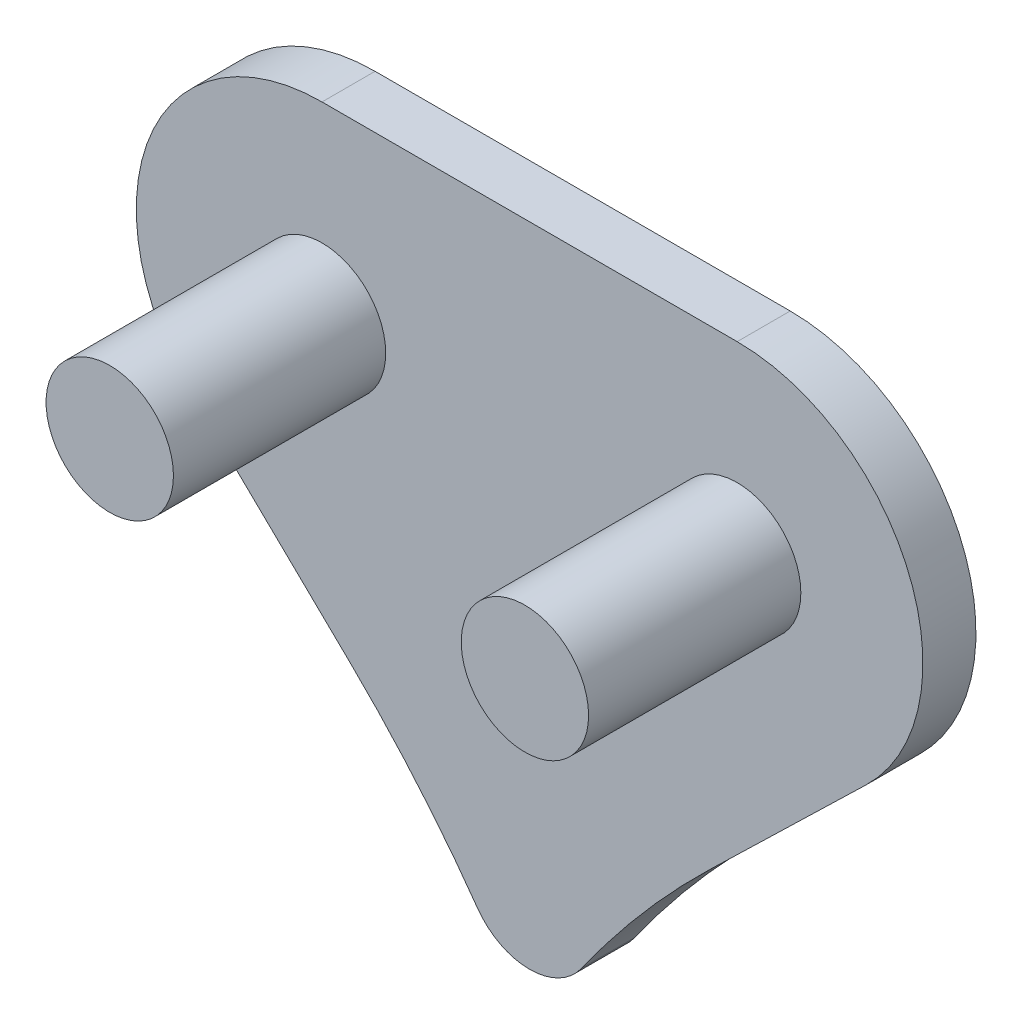
ISO-10303-21;
HEADER;
FILE_DESCRIPTION(('STEP AP214'),'2;1');
FILE_NAME('part.step','',(''),(''),'','','');
FILE_SCHEMA(('AUTOMOTIVE_DESIGN { 1 0 10303 214 1 1 1 1 }'));
ENDSEC;
DATA;
#1=APPLICATION_CONTEXT('core data for automotive mechanical design processes');
#2=APPLICATION_PROTOCOL_DEFINITION('international standard','automotive_design',2000,#1);
#3=PRODUCT_CONTEXT('',#1,'mechanical');
#4=PRODUCT('Part','Part','',(#3));
#5=PRODUCT_RELATED_PRODUCT_CATEGORY('part','',(#4));
#6=PRODUCT_DEFINITION_FORMATION('','',#4);
#7=PRODUCT_DEFINITION_CONTEXT('part definition',#1,'design');
#8=PRODUCT_DEFINITION('design','',#6,#7);
#9=PRODUCT_DEFINITION_SHAPE('','',#8);
#10=(LENGTH_UNIT() NAMED_UNIT(*) SI_UNIT(.MILLI.,.METRE.));
#11=(NAMED_UNIT(*) PLANE_ANGLE_UNIT() SI_UNIT($,.RADIAN.));
#12=(NAMED_UNIT(*) SI_UNIT($,.STERADIAN.) SOLID_ANGLE_UNIT());
#13=UNCERTAINTY_MEASURE_WITH_UNIT(LENGTH_MEASURE(1.E-05),#10,'distance_accuracy_value','');
#14=(GEOMETRIC_REPRESENTATION_CONTEXT(3) GLOBAL_UNCERTAINTY_ASSIGNED_CONTEXT((#13)) GLOBAL_UNIT_ASSIGNED_CONTEXT((#10,
#11,#12)) REPRESENTATION_CONTEXT('',''));
#15=CARTESIAN_POINT('',(0.,0.,0.));
#16=DIRECTION('',(0.,0.,1.));
#17=DIRECTION('',(1.,0.,0.));
#18=AXIS2_PLACEMENT_3D('',#15,#16,#17);
#19=CARTESIAN_POINT('',(-8.09521489057323,-9.86950796640979,0.5));
#20=DIRECTION('',(0.,0.,-1.));
#21=DIRECTION('',(-1.,0.,0.));
#22=AXIS2_PLACEMENT_3D('',#19,#20,#21);
#23=PLANE('',#22);
#24=CARTESIAN_POINT('',(-8.09521489057323,-9.86950796640979,0.5));
#25=DIRECTION('',(0.,0.,-1.));
#26=DIRECTION('',(-1.,0.,0.));
#27=AXIS2_PLACEMENT_3D('',#24,#25,#26);
#28=CIRCLE('',#27,9.99999999999999);
#29=CARTESIAN_POINT('',(-1.13731739875534,-2.68705278079573,0.5));
#30=VERTEX_POINT('',#29);
#31=CARTESIAN_POINT('',(0.0700209980795479,-4.09638724338169,0.5));
#32=VERTEX_POINT('',#31);
#33=EDGE_CURVE('E144',#30,#32,#28,.T.);
#34=ORIENTED_EDGE('',*,*,#33,.T.);
#35=CARTESIAN_POINT('',(0.559935151398721,-3.75,0.5));
#36=DIRECTION('',(0.,0.,1.));
#37=DIRECTION('',(1.,0.,0.));
#38=AXIS2_PLACEMENT_3D('',#35,#36,#37);
#39=CIRCLE('',#38,0.600000000000005);
#40=CARTESIAN_POINT('',(1.04984930471789,-4.09638724338169,0.5));
#41=VERTEX_POINT('',#40);
#42=EDGE_CURVE('E92',#32,#41,#39,.T.);
#43=ORIENTED_EDGE('',*,*,#42,.T.);
#44=CARTESIAN_POINT('',(9.21508519337068,-9.86950796640978,0.5));
#45=DIRECTION('',(0.,0.,-1.));
#46=DIRECTION('',(1.,0.,0.));
#47=AXIS2_PLACEMENT_3D('',#44,#45,#46);
#48=CIRCLE('',#47,10.);
#49=CARTESIAN_POINT('',(2.25718770155278,-2.68705278079573,0.5));
#50=VERTEX_POINT('',#49);
#51=EDGE_CURVE('E159',#41,#50,#48,.T.);
#52=ORIENTED_EDGE('',*,*,#51,.T.);
#53=DIRECTION('',(0.718245518561405,0.69578974918179,0.));
#54=VECTOR('',#53,1.);
#55=CARTESIAN_POINT('',(2.25718770155278,-2.68705278079573,0.5));
#56=LINE('',#55,#54);
#57=CARTESIAN_POINT('',(3.73346631232378,-1.25692965748246,0.5));
#58=VERTEX_POINT('',#57);
#59=EDGE_CURVE('E171',#50,#58,#56,.T.);
#60=ORIENTED_EDGE('',*,*,#59,.T.);
#61=CARTESIAN_POINT('',(2.51583425125565,0.,0.5));
#62=DIRECTION('',(0.,0.,1.));
#63=DIRECTION('',(1.,0.,0.));
#64=AXIS2_PLACEMENT_3D('',#61,#62,#63);
#65=CIRCLE('',#64,1.75);
#66=CARTESIAN_POINT('',(2.51583425125565,1.75,0.5));
#67=VERTEX_POINT('',#66);
#68=EDGE_CURVE('E111',#58,#67,#65,.T.);
#69=ORIENTED_EDGE('',*,*,#68,.T.);
#70=DIRECTION('',(-1.,0.,0.));
#71=VECTOR('',#70,1.);
#72=CARTESIAN_POINT('',(-1.39596394845821,1.75,0.5));
#73=LINE('',#72,#71);
#74=CARTESIAN_POINT('',(-1.39596394845821,1.75,0.5));
#75=VERTEX_POINT('',#74);
#76=EDGE_CURVE('E105',#67,#75,#73,.T.);
#77=ORIENTED_EDGE('',*,*,#76,.T.);
#78=CARTESIAN_POINT('',(-1.39596394845821,0.,0.5));
#79=DIRECTION('',(0.,0.,1.));
#80=DIRECTION('',(1.,0.,0.));
#81=AXIS2_PLACEMENT_3D('',#78,#79,#80);
#82=CIRCLE('',#81,1.75);
#83=CARTESIAN_POINT('',(-2.61359600952634,-1.25692965748246,0.5));
#84=VERTEX_POINT('',#83);
#85=EDGE_CURVE('E109',#75,#84,#82,.T.);
#86=ORIENTED_EDGE('',*,*,#85,.T.);
#87=DIRECTION('',(0.718245518561404,-0.695789749181791,0.));
#88=VECTOR('',#87,1.);
#89=CARTESIAN_POINT('',(-1.13731739875534,-2.68705278079573,0.5));
#90=LINE('',#89,#88);
#91=EDGE_CURVE('E49',#84,#30,#90,.T.);
#92=ORIENTED_EDGE('',*,*,#91,.T.);
#93=EDGE_LOOP('',(#34,#43,#52,#60,#69,#77,#86,#92));
#94=FACE_BOUND('',#93,.T.);
#95=CARTESIAN_POINT('',(-1.39596394845821,0.,0.5));
#96=DIRECTION('',(0.,0.,1.));
#97=DIRECTION('',(1.,0.,0.));
#98=AXIS2_PLACEMENT_3D('',#95,#96,#97);
#99=CIRCLE('',#98,0.6);
#100=CARTESIAN_POINT('',(-0.795963948458211,0.,0.5));
#101=VERTEX_POINT('',#100);
#102=EDGE_CURVE('E133',#101,#101,#99,.T.);
#103=ORIENTED_EDGE('',*,*,#102,.F.);
#104=EDGE_LOOP('',(#103));
#105=FACE_BOUND('',#104,.T.);
#106=CARTESIAN_POINT('',(2.51583425125565,0.,0.5));
#107=DIRECTION('',(0.,0.,1.));
#108=DIRECTION('',(1.,0.,0.));
#109=AXIS2_PLACEMENT_3D('',#106,#107,#108);
#110=CIRCLE('',#109,0.6);
#111=CARTESIAN_POINT('',(3.11583425125565,0.,0.5));
#112=VERTEX_POINT('',#111);
#113=EDGE_CURVE('E179',#112,#112,#110,.T.);
#114=ORIENTED_EDGE('',*,*,#113,.F.);
#115=EDGE_LOOP('',(#114));
#116=FACE_BOUND('',#115,.T.);
#117=ADVANCED_FACE('F32',(#94,#105,#116),#23,.F.);
#118=CARTESIAN_POINT('',(-8.09521489057323,-9.86950796640979,0.));
#119=DIRECTION('',(0.,0.,-1.));
#120=DIRECTION('',(-1.,0.,0.));
#121=AXIS2_PLACEMENT_3D('',#118,#119,#120);
#122=PLANE('',#121);
#123=CARTESIAN_POINT('',(-8.09521489057323,-9.86950796640979,0.));
#124=DIRECTION('',(0.,0.,-1.));
#125=DIRECTION('',(-1.,0.,0.));
#126=AXIS2_PLACEMENT_3D('',#123,#124,#125);
#127=CIRCLE('',#126,9.99999999999999);
#128=CARTESIAN_POINT('',(-1.13731739875534,-2.68705278079573,0.));
#129=VERTEX_POINT('',#128);
#130=CARTESIAN_POINT('',(0.0700209980795479,-4.09638724338169,0.));
#131=VERTEX_POINT('',#130);
#132=EDGE_CURVE('E129',#129,#131,#127,.T.);
#133=ORIENTED_EDGE('',*,*,#132,.F.);
#134=DIRECTION('',(0.718245518561404,-0.695789749181791,0.));
#135=VECTOR('',#134,1.);
#136=CARTESIAN_POINT('',(-1.13731739875534,-2.68705278079573,0.));
#137=LINE('',#136,#135);
#138=CARTESIAN_POINT('',(-2.61359600952634,-1.25692965748246,0.));
#139=VERTEX_POINT('',#138);
#140=EDGE_CURVE('E84',#139,#129,#137,.T.);
#141=ORIENTED_EDGE('',*,*,#140,.F.);
#142=CARTESIAN_POINT('',(-1.39596394845821,0.,0.));
#143=DIRECTION('',(0.,0.,1.));
#144=DIRECTION('',(1.,0.,0.));
#145=AXIS2_PLACEMENT_3D('',#142,#143,#144);
#146=CIRCLE('',#145,1.75);
#147=CARTESIAN_POINT('',(-1.39596394845821,1.75,0.));
#148=VERTEX_POINT('',#147);
#149=EDGE_CURVE('E78',#148,#139,#146,.T.);
#150=ORIENTED_EDGE('',*,*,#149,.F.);
#151=DIRECTION('',(-1.,0.,0.));
#152=VECTOR('',#151,1.);
#153=CARTESIAN_POINT('',(-1.39596394845821,1.75,0.));
#154=LINE('',#153,#152);
#155=CARTESIAN_POINT('',(2.51583425125565,1.75,0.));
#156=VERTEX_POINT('',#155);
#157=EDGE_CURVE('E119',#156,#148,#154,.T.);
#158=ORIENTED_EDGE('',*,*,#157,.F.);
#159=CARTESIAN_POINT('',(2.51583425125565,0.,0.));
#160=DIRECTION('',(0.,0.,1.));
#161=DIRECTION('',(1.,0.,0.));
#162=AXIS2_PLACEMENT_3D('',#159,#160,#161);
#163=CIRCLE('',#162,1.75);
#164=CARTESIAN_POINT('',(3.73346631232378,-1.25692965748246,0.));
#165=VERTEX_POINT('',#164);
#166=EDGE_CURVE('E139',#165,#156,#163,.T.);
#167=ORIENTED_EDGE('',*,*,#166,.F.);
#168=DIRECTION('',(0.718245518561405,0.69578974918179,0.));
#169=VECTOR('',#168,1.);
#170=CARTESIAN_POINT('',(2.25718770155278,-2.68705278079573,0.));
#171=LINE('',#170,#169);
#172=CARTESIAN_POINT('',(2.25718770155278,-2.68705278079573,0.));
#173=VERTEX_POINT('',#172);
#174=EDGE_CURVE('E137',#173,#165,#171,.T.);
#175=ORIENTED_EDGE('',*,*,#174,.F.);
#176=CARTESIAN_POINT('',(9.21508519337068,-9.86950796640978,0.));
#177=DIRECTION('',(0.,0.,-1.));
#178=DIRECTION('',(1.,0.,0.));
#179=AXIS2_PLACEMENT_3D('',#176,#177,#178);
#180=CIRCLE('',#179,10.);
#181=CARTESIAN_POINT('',(1.04984930471789,-4.09638724338169,0.));
#182=VERTEX_POINT('',#181);
#183=EDGE_CURVE('E135',#182,#173,#180,.T.);
#184=ORIENTED_EDGE('',*,*,#183,.F.);
#185=CARTESIAN_POINT('',(0.559935151398721,-3.75,0.));
#186=DIRECTION('',(0.,0.,1.));
#187=DIRECTION('',(1.,0.,0.));
#188=AXIS2_PLACEMENT_3D('',#185,#186,#187);
#189=CIRCLE('',#188,0.600000000000005);
#190=EDGE_CURVE('E132',#131,#182,#189,.T.);
#191=ORIENTED_EDGE('',*,*,#190,.F.);
#192=EDGE_LOOP('',(#133,#141,#150,#158,#167,#175,#184,#191));
#193=FACE_BOUND('',#192,.T.);
#194=ADVANCED_FACE('F163',(#193),#122,.T.);
#195=CARTESIAN_POINT('',(-8.09521489057323,-9.86950796640979,0.5));
#196=DIRECTION('',(0.,0.,-1.));
#197=DIRECTION('',(-1.,0.,0.));
#198=AXIS2_PLACEMENT_3D('',#195,#196,#197);
#199=CYLINDRICAL_SURFACE('',#198,9.99999999999999);
#200=ORIENTED_EDGE('',*,*,#132,.T.);
#201=DIRECTION('',(0.,0.,-1.));
#202=VECTOR('',#201,1.);
#203=CARTESIAN_POINT('',(0.0700209980795479,-4.09638724338169,0.5));
#204=LINE('',#203,#202);
#205=EDGE_CURVE('E11',#32,#131,#204,.T.);
#206=ORIENTED_EDGE('',*,*,#205,.F.);
#207=ORIENTED_EDGE('',*,*,#33,.F.);
#208=DIRECTION('',(0.,0.,-1.));
#209=VECTOR('',#208,1.);
#210=CARTESIAN_POINT('',(-1.13731739875534,-2.68705278079573,0.5));
#211=LINE('',#210,#209);
#212=EDGE_CURVE('E125',#30,#129,#211,.T.);
#213=ORIENTED_EDGE('',*,*,#212,.T.);
#214=EDGE_LOOP('',(#200,#206,#207,#213));
#215=FACE_BOUND('',#214,.T.);
#216=ADVANCED_FACE('F34',(#215),#199,.F.);
#217=CARTESIAN_POINT('',(0.559935151398721,-3.75,0.5));
#218=DIRECTION('',(0.,0.,-1.));
#219=DIRECTION('',(-1.,0.,0.));
#220=AXIS2_PLACEMENT_3D('',#217,#218,#219);
#221=CYLINDRICAL_SURFACE('',#220,0.600000000000005);
#222=ORIENTED_EDGE('',*,*,#190,.T.);
#223=DIRECTION('',(0.,0.,-1.));
#224=VECTOR('',#223,1.);
#225=CARTESIAN_POINT('',(1.04984930471789,-4.09638724338169,0.5));
#226=LINE('',#225,#224);
#227=EDGE_CURVE('E41',#41,#182,#226,.T.);
#228=ORIENTED_EDGE('',*,*,#227,.F.);
#229=ORIENTED_EDGE('',*,*,#42,.F.);
#230=ORIENTED_EDGE('',*,*,#205,.T.);
#231=EDGE_LOOP('',(#222,#228,#229,#230));
#232=FACE_BOUND('',#231,.T.);
#233=ADVANCED_FACE('F220',(#232),#221,.T.);
#234=CARTESIAN_POINT('',(9.21508519337068,-9.86950796640978,0.5));
#235=DIRECTION('',(0.,0.,-1.));
#236=DIRECTION('',(-1.,0.,0.));
#237=AXIS2_PLACEMENT_3D('',#234,#235,#236);
#238=CYLINDRICAL_SURFACE('',#237,10.);
#239=ORIENTED_EDGE('',*,*,#183,.T.);
#240=DIRECTION('',(0.,0.,-1.));
#241=VECTOR('',#240,1.);
#242=CARTESIAN_POINT('',(2.25718770155278,-2.68705278079573,0.5));
#243=LINE('',#242,#241);
#244=EDGE_CURVE('E151',#50,#173,#243,.T.);
#245=ORIENTED_EDGE('',*,*,#244,.F.);
#246=ORIENTED_EDGE('',*,*,#51,.F.);
#247=ORIENTED_EDGE('',*,*,#227,.T.);
#248=EDGE_LOOP('',(#239,#245,#246,#247));
#249=FACE_BOUND('',#248,.T.);
#250=ADVANCED_FACE('F157',(#249),#238,.F.);
#251=CARTESIAN_POINT('',(2.25718770155278,-2.68705278079573,0.5));
#252=DIRECTION('',(-0.69578974918179,0.718245518561405,0.));
#253=DIRECTION('',(-0.718245518561405,-0.69578974918179,0.));
#254=AXIS2_PLACEMENT_3D('',#251,#252,#253);
#255=PLANE('',#254);
#256=ORIENTED_EDGE('',*,*,#174,.T.);
#257=DIRECTION('',(0.,0.,-1.));
#258=VECTOR('',#257,1.);
#259=CARTESIAN_POINT('',(3.73346631232378,-1.25692965748246,0.5));
#260=LINE('',#259,#258);
#261=EDGE_CURVE('E148',#58,#165,#260,.T.);
#262=ORIENTED_EDGE('',*,*,#261,.F.);
#263=ORIENTED_EDGE('',*,*,#59,.F.);
#264=ORIENTED_EDGE('',*,*,#244,.T.);
#265=EDGE_LOOP('',(#256,#262,#263,#264));
#266=FACE_BOUND('',#265,.T.);
#267=ADVANCED_FACE('F167',(#266),#255,.F.);
#268=CARTESIAN_POINT('',(2.51583425125565,0.,0.5));
#269=DIRECTION('',(0.,0.,-1.));
#270=DIRECTION('',(-1.,0.,0.));
#271=AXIS2_PLACEMENT_3D('',#268,#269,#270);
#272=CYLINDRICAL_SURFACE('',#271,1.75);
#273=ORIENTED_EDGE('',*,*,#166,.T.);
#274=DIRECTION('',(0.,0.,-1.));
#275=VECTOR('',#274,1.);
#276=CARTESIAN_POINT('',(2.51583425125565,1.75,0.5));
#277=LINE('',#276,#275);
#278=EDGE_CURVE('E120',#67,#156,#277,.T.);
#279=ORIENTED_EDGE('',*,*,#278,.F.);
#280=ORIENTED_EDGE('',*,*,#68,.F.);
#281=ORIENTED_EDGE('',*,*,#261,.T.);
#282=EDGE_LOOP('',(#273,#279,#280,#281));
#283=FACE_BOUND('',#282,.T.);
#284=ADVANCED_FACE('F170',(#283),#272,.T.);
#285=CARTESIAN_POINT('',(-1.39596394845821,1.75,0.5));
#286=DIRECTION('',(0.,-1.,0.));
#287=DIRECTION('',(0.,0.,-1.));
#288=AXIS2_PLACEMENT_3D('',#285,#286,#287);
#289=PLANE('',#288);
#290=ORIENTED_EDGE('',*,*,#157,.T.);
#291=DIRECTION('',(0.,0.,-1.));
#292=VECTOR('',#291,1.);
#293=CARTESIAN_POINT('',(-1.39596394845821,1.75,0.5));
#294=LINE('',#293,#292);
#295=EDGE_CURVE('E116',#75,#148,#294,.T.);
#296=ORIENTED_EDGE('',*,*,#295,.F.);
#297=ORIENTED_EDGE('',*,*,#76,.F.);
#298=ORIENTED_EDGE('',*,*,#278,.T.);
#299=EDGE_LOOP('',(#290,#296,#297,#298));
#300=FACE_BOUND('',#299,.T.);
#301=ADVANCED_FACE('F117',(#300),#289,.F.);
#302=CARTESIAN_POINT('',(-1.39596394845821,0.,0.5));
#303=DIRECTION('',(0.,0.,-1.));
#304=DIRECTION('',(-1.,0.,0.));
#305=AXIS2_PLACEMENT_3D('',#302,#303,#304);
#306=CYLINDRICAL_SURFACE('',#305,1.75);
#307=ORIENTED_EDGE('',*,*,#149,.T.);
#308=DIRECTION('',(0.,0.,-1.));
#309=VECTOR('',#308,1.);
#310=CARTESIAN_POINT('',(-2.61359600952634,-1.25692965748246,0.5));
#311=LINE('',#310,#309);
#312=EDGE_CURVE('E121',#84,#139,#311,.T.);
#313=ORIENTED_EDGE('',*,*,#312,.F.);
#314=ORIENTED_EDGE('',*,*,#85,.F.);
#315=ORIENTED_EDGE('',*,*,#295,.T.);
#316=EDGE_LOOP('',(#307,#313,#314,#315));
#317=FACE_BOUND('',#316,.T.);
#318=ADVANCED_FACE('F123',(#317),#306,.T.);
#319=CARTESIAN_POINT('',(-1.13731739875534,-2.68705278079573,0.5));
#320=DIRECTION('',(0.695789749181791,0.718245518561404,0.));
#321=DIRECTION('',(-0.718245518561404,0.695789749181791,0.));
#322=AXIS2_PLACEMENT_3D('',#319,#320,#321);
#323=PLANE('',#322);
#324=ORIENTED_EDGE('',*,*,#140,.T.);
#325=ORIENTED_EDGE('',*,*,#212,.F.);
#326=ORIENTED_EDGE('',*,*,#91,.F.);
#327=ORIENTED_EDGE('',*,*,#312,.T.);
#328=EDGE_LOOP('',(#324,#325,#326,#327));
#329=FACE_BOUND('',#328,.T.);
#330=ADVANCED_FACE('F208',(#329),#323,.F.);
#331=CARTESIAN_POINT('',(-1.39596394845821,0.,0.));
#332=DIRECTION('',(0.,0.,1.));
#333=DIRECTION('',(1.,0.,0.));
#334=AXIS2_PLACEMENT_3D('',#331,#332,#333);
#335=CYLINDRICAL_SURFACE('',#334,0.6);
#336=CARTESIAN_POINT('',(-1.39596394845821,0.,2.5));
#337=DIRECTION('',(0.,0.,1.));
#338=DIRECTION('',(1.,0.,0.));
#339=AXIS2_PLACEMENT_3D('',#336,#337,#338);
#340=CIRCLE('',#339,0.6);
#341=CARTESIAN_POINT('',(-0.795963948458211,0.,2.5));
#342=VERTEX_POINT('',#341);
#343=EDGE_CURVE('E182',#342,#342,#340,.T.);
#344=ORIENTED_EDGE('',*,*,#343,.F.);
#345=EDGE_LOOP('',(#344));
#346=FACE_BOUND('',#345,.T.);
#347=ORIENTED_EDGE('',*,*,#102,.T.);
#348=EDGE_LOOP('',(#347));
#349=FACE_BOUND('',#348,.T.);
#350=ADVANCED_FACE('F205',(#346,#349),#335,.T.);
#351=CARTESIAN_POINT('',(-1.39596394845821,0.,2.5));
#352=DIRECTION('',(0.,0.,1.));
#353=DIRECTION('',(1.,0.,0.));
#354=AXIS2_PLACEMENT_3D('',#351,#352,#353);
#355=PLANE('',#354);
#356=ORIENTED_EDGE('',*,*,#343,.T.);
#357=EDGE_LOOP('',(#356));
#358=FACE_BOUND('',#357,.T.);
#359=ADVANCED_FACE('F194',(#358),#355,.T.);
#360=CARTESIAN_POINT('',(2.51583425125565,0.,0.));
#361=DIRECTION('',(0.,0.,1.));
#362=DIRECTION('',(1.,0.,0.));
#363=AXIS2_PLACEMENT_3D('',#360,#361,#362);
#364=CYLINDRICAL_SURFACE('',#363,0.6);
#365=CARTESIAN_POINT('',(2.51583425125565,0.,2.5));
#366=DIRECTION('',(0.,0.,1.));
#367=DIRECTION('',(1.,0.,0.));
#368=AXIS2_PLACEMENT_3D('',#365,#366,#367);
#369=CIRCLE('',#368,0.6);
#370=CARTESIAN_POINT('',(3.11583425125565,0.,2.5));
#371=VERTEX_POINT('',#370);
#372=EDGE_CURVE('E185',#371,#371,#369,.T.);
#373=ORIENTED_EDGE('',*,*,#372,.F.);
#374=EDGE_LOOP('',(#373));
#375=FACE_BOUND('',#374,.T.);
#376=ORIENTED_EDGE('',*,*,#113,.T.);
#377=EDGE_LOOP('',(#376));
#378=FACE_BOUND('',#377,.T.);
#379=ADVANCED_FACE('F191',(#375,#378),#364,.T.);
#380=CARTESIAN_POINT('',(2.51583425125565,0.,2.5));
#381=DIRECTION('',(0.,0.,1.));
#382=DIRECTION('',(1.,0.,0.));
#383=AXIS2_PLACEMENT_3D('',#380,#381,#382);
#384=PLANE('',#383);
#385=ORIENTED_EDGE('',*,*,#372,.T.);
#386=EDGE_LOOP('',(#385));
#387=FACE_BOUND('',#386,.T.);
#388=ADVANCED_FACE('F189',(#387),#384,.T.);
#389=CLOSED_SHELL('',(#117,#194,#216,#233,#250,#267,#284,#301,#318,#330,#350,#359,#379,#388));
#390=MANIFOLD_SOLID_BREP('B2',#389);
#391=ADVANCED_BREP_SHAPE_REPRESENTATION('',(#18,#390),#14);
#392=SHAPE_DEFINITION_REPRESENTATION(#9,#391);
ENDSEC;
END-ISO-10303-21;
